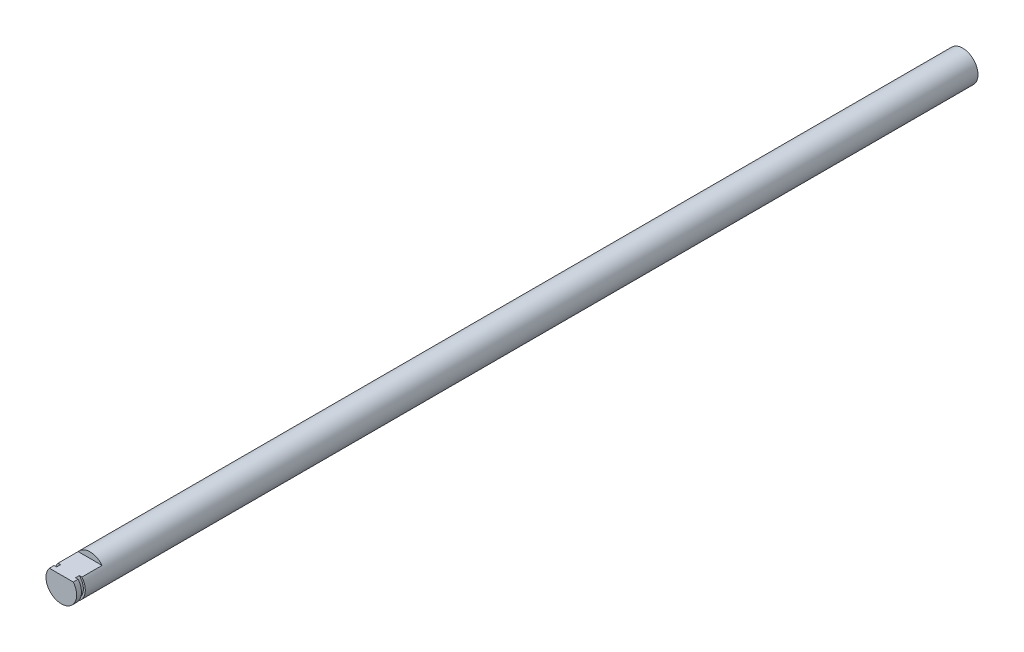
ISO-10303-21;
HEADER;
FILE_DESCRIPTION(('STEP AP214'),'2;1');
FILE_NAME('part.step','',(''),(''),'','','');
FILE_SCHEMA(('AUTOMOTIVE_DESIGN { 1 0 10303 214 1 1 1 1 }'));
ENDSEC;
DATA;
#1=APPLICATION_CONTEXT('core data for automotive mechanical design processes');
#2=APPLICATION_PROTOCOL_DEFINITION('international standard','automotive_design',2000,#1);
#3=PRODUCT_CONTEXT('',#1,'mechanical');
#4=PRODUCT('Part','Part','',(#3));
#5=PRODUCT_RELATED_PRODUCT_CATEGORY('part','',(#4));
#6=PRODUCT_DEFINITION_FORMATION('','',#4);
#7=PRODUCT_DEFINITION_CONTEXT('part definition',#1,'design');
#8=PRODUCT_DEFINITION('design','',#6,#7);
#9=PRODUCT_DEFINITION_SHAPE('','',#8);
#10=(LENGTH_UNIT() NAMED_UNIT(*) SI_UNIT(.MILLI.,.METRE.));
#11=(NAMED_UNIT(*) PLANE_ANGLE_UNIT() SI_UNIT($,.RADIAN.));
#12=(NAMED_UNIT(*) SI_UNIT($,.STERADIAN.) SOLID_ANGLE_UNIT());
#13=UNCERTAINTY_MEASURE_WITH_UNIT(LENGTH_MEASURE(1.E-05),#10,'distance_accuracy_value','');
#14=(GEOMETRIC_REPRESENTATION_CONTEXT(3) GLOBAL_UNCERTAINTY_ASSIGNED_CONTEXT((#13)) GLOBAL_UNIT_ASSIGNED_CONTEXT((#10,
#11,#12)) REPRESENTATION_CONTEXT('',''));
#15=CARTESIAN_POINT('',(0.,0.,0.));
#16=DIRECTION('',(0.,0.,1.));
#17=DIRECTION('',(1.,0.,0.));
#18=AXIS2_PLACEMENT_3D('',#15,#16,#17);
#19=CARTESIAN_POINT('',(0.,0.,235.));
#20=DIRECTION('',(0.,0.,-1.));
#21=DIRECTION('',(-1.,0.,0.));
#22=AXIS2_PLACEMENT_3D('',#19,#20,#21);
#23=CYLINDRICAL_SURFACE('',#22,4.);
#24=CARTESIAN_POINT('',(0.,0.,0.));
#25=DIRECTION('',(0.,0.,1.));
#26=DIRECTION('',(1.,0.,0.));
#27=AXIS2_PLACEMENT_3D('',#24,#25,#26);
#28=CIRCLE('',#27,4.);
#29=CARTESIAN_POINT('',(4.,0.,0.));
#30=VERTEX_POINT('',#29);
#31=EDGE_CURVE('E112',#30,#30,#28,.T.);
#32=ORIENTED_EDGE('',*,*,#31,.T.);
#33=EDGE_LOOP('',(#32));
#34=FACE_BOUND('',#33,.T.);
#35=CARTESIAN_POINT('',(0.,0.,232.75));
#36=DIRECTION('',(0.,0.,1.));
#37=DIRECTION('',(1.,0.,0.));
#38=AXIS2_PLACEMENT_3D('',#35,#36,#37);
#39=CIRCLE('',#38,4.);
#40=CARTESIAN_POINT('',(-3.1224989991992,2.5,232.75));
#41=VERTEX_POINT('',#40);
#42=CARTESIAN_POINT('',(3.1224989991992,2.5,232.75));
#43=VERTEX_POINT('',#42);
#44=EDGE_CURVE('E96',#41,#43,#39,.T.);
#45=ORIENTED_EDGE('',*,*,#44,.F.);
#46=DIRECTION('',(0.,0.,1.));
#47=VECTOR('',#46,1.);
#48=CARTESIAN_POINT('',(-3.1224989991992,2.5,227.5));
#49=LINE('',#48,#47);
#50=CARTESIAN_POINT('',(-3.1224989991992,2.5,227.5));
#51=VERTEX_POINT('',#50);
#52=EDGE_CURVE('E118',#51,#41,#49,.T.);
#53=ORIENTED_EDGE('',*,*,#52,.F.);
#54=CARTESIAN_POINT('',(0.,0.,227.5));
#55=DIRECTION('',(0.,0.,1.));
#56=DIRECTION('',(1.,0.,0.));
#57=AXIS2_PLACEMENT_3D('',#54,#55,#56);
#58=CIRCLE('',#57,4.);
#59=CARTESIAN_POINT('',(3.1224989991992,2.5,227.5));
#60=VERTEX_POINT('',#59);
#61=EDGE_CURVE('E125',#60,#51,#58,.T.);
#62=ORIENTED_EDGE('',*,*,#61,.F.);
#63=DIRECTION('',(0.,0.,1.));
#64=VECTOR('',#63,1.);
#65=CARTESIAN_POINT('',(3.1224989991992,2.5,227.5));
#66=LINE('',#65,#64);
#67=EDGE_CURVE('E115',#60,#43,#66,.T.);
#68=ORIENTED_EDGE('',*,*,#67,.T.);
#69=EDGE_LOOP('',(#45,#53,#62,#68));
#70=FACE_BOUND('',#69,.T.);
#71=ADVANCED_FACE('F35',(#34,#70),#23,.T.);
#72=CARTESIAN_POINT('',(3.1224989991992,2.5,227.5));
#73=DIRECTION('',(0.,-1.,0.));
#74=DIRECTION('',(0.,0.,-1.));
#75=AXIS2_PLACEMENT_3D('',#72,#73,#74);
#76=PLANE('',#75);
#77=DIRECTION('',(-1.,0.,0.));
#78=VECTOR('',#77,1.);
#79=CARTESIAN_POINT('',(3.1224989991992,2.5,232.75));
#80=LINE('',#79,#78);
#81=CARTESIAN_POINT('',(2.44948974278318,2.5,232.75));
#82=VERTEX_POINT('',#81);
#83=EDGE_CURVE('E11',#43,#82,#80,.T.);
#84=ORIENTED_EDGE('',*,*,#83,.F.);
#85=ORIENTED_EDGE('',*,*,#67,.F.);
#86=DIRECTION('',(1.,0.,0.));
#87=VECTOR('',#86,1.);
#88=CARTESIAN_POINT('',(3.1224989991992,2.5,227.5));
#89=LINE('',#88,#87);
#90=EDGE_CURVE('E126',#51,#60,#89,.T.);
#91=ORIENTED_EDGE('',*,*,#90,.F.);
#92=ORIENTED_EDGE('',*,*,#52,.T.);
#93=CARTESIAN_POINT('',(-2.44948974278318,2.5,232.75));
#94=VERTEX_POINT('',#93);
#95=EDGE_CURVE('E45',#94,#41,#80,.T.);
#96=ORIENTED_EDGE('',*,*,#95,.F.);
#97=DIRECTION('',(0.,0.,1.));
#98=VECTOR('',#97,1.);
#99=CARTESIAN_POINT('',(-2.44948974278318,2.5,232.75));
#100=LINE('',#99,#98);
#101=CARTESIAN_POINT('',(-2.44948974278318,2.5,233.75));
#102=VERTEX_POINT('',#101);
#103=EDGE_CURVE('E101',#102,#94,#100,.F.);
#104=ORIENTED_EDGE('',*,*,#103,.F.);
#105=DIRECTION('',(-1.,0.,0.));
#106=VECTOR('',#105,1.);
#107=CARTESIAN_POINT('',(3.1224989991992,2.5,233.75));
#108=LINE('',#107,#106);
#109=CARTESIAN_POINT('',(-3.1224989991992,2.5,233.75));
#110=VERTEX_POINT('',#109);
#111=EDGE_CURVE('E108',#102,#110,#108,.T.);
#112=ORIENTED_EDGE('',*,*,#111,.T.);
#113=CARTESIAN_POINT('',(-3.1224989991992,2.5,235.));
#114=VERTEX_POINT('',#113);
#115=EDGE_CURVE('E60',#110,#114,#49,.T.);
#116=ORIENTED_EDGE('',*,*,#115,.T.);
#117=DIRECTION('',(1.,0.,0.));
#118=VECTOR('',#117,1.);
#119=CARTESIAN_POINT('',(3.1224989991992,2.5,235.));
#120=LINE('',#119,#118);
#121=CARTESIAN_POINT('',(3.1224989991992,2.5,235.));
#122=VERTEX_POINT('',#121);
#123=EDGE_CURVE('E123',#114,#122,#120,.T.);
#124=ORIENTED_EDGE('',*,*,#123,.T.);
#125=CARTESIAN_POINT('',(3.1224989991992,2.5,233.75));
#126=VERTEX_POINT('',#125);
#127=EDGE_CURVE('E121',#126,#122,#66,.T.);
#128=ORIENTED_EDGE('',*,*,#127,.F.);
#129=CARTESIAN_POINT('',(2.44948974278318,2.5,233.75));
#130=VERTEX_POINT('',#129);
#131=EDGE_CURVE('E44',#126,#130,#108,.T.);
#132=ORIENTED_EDGE('',*,*,#131,.T.);
#133=DIRECTION('',(0.,0.,1.));
#134=VECTOR('',#133,1.);
#135=CARTESIAN_POINT('',(2.44948974278318,2.5,232.75));
#136=LINE('',#135,#134);
#137=EDGE_CURVE('E39',#82,#130,#136,.T.);
#138=ORIENTED_EDGE('',*,*,#137,.F.);
#139=EDGE_LOOP('',(#84,#85,#91,#92,#96,#104,#112,#116,#124,#128,#132,#138));
#140=FACE_BOUND('',#139,.T.);
#141=ADVANCED_FACE('F105',(#140),#76,.F.);
#142=ORIENTED_EDGE('',*,*,#115,.F.);
#143=CARTESIAN_POINT('',(0.,0.,233.75));
#144=DIRECTION('',(0.,0.,1.));
#145=DIRECTION('',(1.,0.,0.));
#146=AXIS2_PLACEMENT_3D('',#143,#144,#145);
#147=CIRCLE('',#146,4.);
#148=EDGE_CURVE('E102',#110,#126,#147,.T.);
#149=ORIENTED_EDGE('',*,*,#148,.T.);
#150=ORIENTED_EDGE('',*,*,#127,.T.);
#151=CARTESIAN_POINT('',(0.,0.,235.));
#152=DIRECTION('',(0.,0.,1.));
#153=DIRECTION('',(1.,0.,0.));
#154=AXIS2_PLACEMENT_3D('',#151,#152,#153);
#155=CIRCLE('',#154,4.);
#156=EDGE_CURVE('E111',#114,#122,#155,.T.);
#157=ORIENTED_EDGE('',*,*,#156,.F.);
#158=EDGE_LOOP('',(#142,#149,#150,#157));
#159=FACE_BOUND('',#158,.T.);
#160=ADVANCED_FACE('F37',(#159),#23,.T.);
#161=CARTESIAN_POINT('',(0.,0.,235.));
#162=DIRECTION('',(0.,0.,1.));
#163=DIRECTION('',(1.,0.,0.));
#164=AXIS2_PLACEMENT_3D('',#161,#162,#163);
#165=PLANE('',#164);
#166=ORIENTED_EDGE('',*,*,#123,.F.);
#167=ORIENTED_EDGE('',*,*,#156,.T.);
#168=EDGE_LOOP('',(#166,#167));
#169=FACE_BOUND('',#168,.T.);
#170=ADVANCED_FACE('F149',(#169),#165,.T.);
#171=CARTESIAN_POINT('',(0.,0.,0.));
#172=DIRECTION('',(0.,0.,1.));
#173=DIRECTION('',(1.,0.,0.));
#174=AXIS2_PLACEMENT_3D('',#171,#172,#173);
#175=PLANE('',#174);
#176=ORIENTED_EDGE('',*,*,#31,.F.);
#177=EDGE_LOOP('',(#176));
#178=FACE_BOUND('',#177,.T.);
#179=ADVANCED_FACE('F142',(#178),#175,.F.);
#180=CARTESIAN_POINT('',(0.,0.,227.5));
#181=DIRECTION('',(0.,0.,1.));
#182=DIRECTION('',(1.,0.,0.));
#183=AXIS2_PLACEMENT_3D('',#180,#181,#182);
#184=PLANE('',#183);
#185=ORIENTED_EDGE('',*,*,#61,.T.);
#186=ORIENTED_EDGE('',*,*,#90,.T.);
#187=EDGE_LOOP('',(#185,#186));
#188=FACE_BOUND('',#187,.T.);
#189=ADVANCED_FACE('F140',(#188),#184,.T.);
#190=CARTESIAN_POINT('',(0.,0.,232.75));
#191=DIRECTION('',(0.,0.,1.));
#192=DIRECTION('',(1.,0.,0.));
#193=AXIS2_PLACEMENT_3D('',#190,#191,#192);
#194=PLANE('',#193);
#195=ORIENTED_EDGE('',*,*,#83,.T.);
#196=CARTESIAN_POINT('',(0.,0.,232.75));
#197=DIRECTION('',(0.,0.,1.));
#198=DIRECTION('',(1.,0.,0.));
#199=AXIS2_PLACEMENT_3D('',#196,#197,#198);
#200=CIRCLE('',#199,3.5);
#201=EDGE_CURVE('E93',#94,#82,#200,.T.);
#202=ORIENTED_EDGE('',*,*,#201,.F.);
#203=ORIENTED_EDGE('',*,*,#95,.T.);
#204=ORIENTED_EDGE('',*,*,#44,.T.);
#205=EDGE_LOOP('',(#195,#202,#203,#204));
#206=FACE_BOUND('',#205,.T.);
#207=ADVANCED_FACE('F92',(#206),#194,.T.);
#208=CARTESIAN_POINT('',(0.,0.,233.75));
#209=DIRECTION('',(0.,0.,1.));
#210=DIRECTION('',(1.,0.,0.));
#211=AXIS2_PLACEMENT_3D('',#208,#209,#210);
#212=PLANE('',#211);
#213=ORIENTED_EDGE('',*,*,#148,.F.);
#214=ORIENTED_EDGE('',*,*,#111,.F.);
#215=CARTESIAN_POINT('',(0.,0.,233.75));
#216=DIRECTION('',(0.,0.,1.));
#217=DIRECTION('',(1.,0.,0.));
#218=AXIS2_PLACEMENT_3D('',#215,#216,#217);
#219=CIRCLE('',#218,3.5);
#220=EDGE_CURVE('E52',#102,#130,#219,.T.);
#221=ORIENTED_EDGE('',*,*,#220,.T.);
#222=ORIENTED_EDGE('',*,*,#131,.F.);
#223=EDGE_LOOP('',(#213,#214,#221,#222));
#224=FACE_BOUND('',#223,.T.);
#225=ADVANCED_FACE('F134',(#224),#212,.F.);
#226=CARTESIAN_POINT('',(0.,0.,232.75));
#227=DIRECTION('',(0.,0.,1.));
#228=DIRECTION('',(1.,0.,0.));
#229=AXIS2_PLACEMENT_3D('',#226,#227,#228);
#230=CYLINDRICAL_SURFACE('',#229,3.5);
#231=ORIENTED_EDGE('',*,*,#137,.T.);
#232=ORIENTED_EDGE('',*,*,#220,.F.);
#233=ORIENTED_EDGE('',*,*,#103,.T.);
#234=ORIENTED_EDGE('',*,*,#201,.T.);
#235=EDGE_LOOP('',(#231,#232,#233,#234));
#236=FACE_BOUND('',#235,.T.);
#237=ADVANCED_FACE('F99',(#236),#230,.T.);
#238=CLOSED_SHELL('',(#71,#141,#160,#170,#179,#189,#207,#225,#237));
#239=MANIFOLD_SOLID_BREP('B2',#238);
#240=ADVANCED_BREP_SHAPE_REPRESENTATION('',(#18,#239),#14);
#241=SHAPE_DEFINITION_REPRESENTATION(#9,#240);
ENDSEC;
END-ISO-10303-21;
